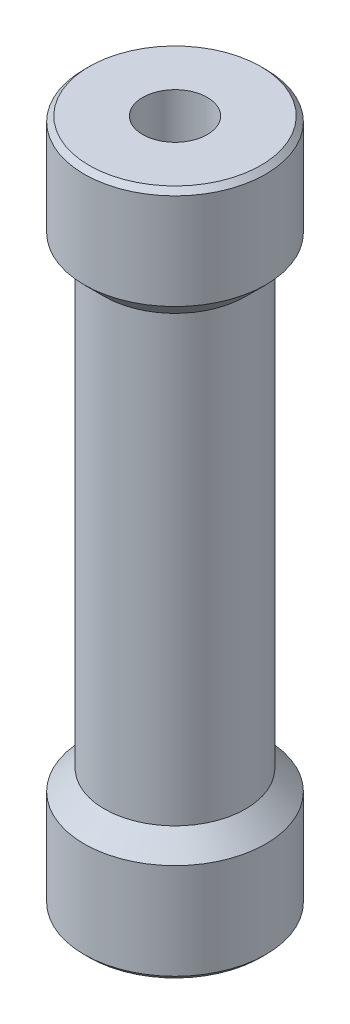
ISO-10303-21;
HEADER;
FILE_DESCRIPTION(('STEP AP214'),'2;1');
FILE_NAME('part.step','',(''),(''),'','','');
FILE_SCHEMA(('AUTOMOTIVE_DESIGN { 1 0 10303 214 1 1 1 1 }'));
ENDSEC;
DATA;
#1=APPLICATION_CONTEXT('core data for automotive mechanical design processes');
#2=APPLICATION_PROTOCOL_DEFINITION('international standard','automotive_design',2000,#1);
#3=PRODUCT_CONTEXT('',#1,'mechanical');
#4=PRODUCT('Part','Part','',(#3));
#5=PRODUCT_RELATED_PRODUCT_CATEGORY('part','',(#4));
#6=PRODUCT_DEFINITION_FORMATION('','',#4);
#7=PRODUCT_DEFINITION_CONTEXT('part definition',#1,'design');
#8=PRODUCT_DEFINITION('design','',#6,#7);
#9=PRODUCT_DEFINITION_SHAPE('','',#8);
#10=(LENGTH_UNIT() NAMED_UNIT(*) SI_UNIT(.MILLI.,.METRE.));
#11=(NAMED_UNIT(*) PLANE_ANGLE_UNIT() SI_UNIT($,.RADIAN.));
#12=(NAMED_UNIT(*) SI_UNIT($,.STERADIAN.) SOLID_ANGLE_UNIT());
#13=UNCERTAINTY_MEASURE_WITH_UNIT(LENGTH_MEASURE(1.E-05),#10,'distance_accuracy_value','');
#14=(GEOMETRIC_REPRESENTATION_CONTEXT(3) GLOBAL_UNCERTAINTY_ASSIGNED_CONTEXT((#13)) GLOBAL_UNIT_ASSIGNED_CONTEXT((#10,
#11,#12)) REPRESENTATION_CONTEXT('',''));
#15=CARTESIAN_POINT('',(0.,0.,0.));
#16=DIRECTION('',(0.,0.,1.));
#17=DIRECTION('',(1.,0.,0.));
#18=AXIS2_PLACEMENT_3D('',#15,#16,#17);
#19=CARTESIAN_POINT('',(0.,0.,0.));
#20=DIRECTION('',(0.,1.,0.));
#21=DIRECTION('',(0.,0.,1.));
#22=AXIS2_PLACEMENT_3D('',#19,#20,#21);
#23=CYLINDRICAL_SURFACE('',#22,1.6);
#24=CARTESIAN_POINT('',(0.,0.,0.));
#25=DIRECTION('',(0.,1.,0.));
#26=DIRECTION('',(0.,0.,1.));
#27=AXIS2_PLACEMENT_3D('',#24,#25,#26);
#28=CIRCLE('',#27,1.6);
#29=CARTESIAN_POINT('',(0.,0.,1.6));
#30=VERTEX_POINT('',#29);
#31=EDGE_CURVE('E45',#30,#30,#28,.F.);
#32=ORIENTED_EDGE('',*,*,#31,.T.);
#33=EDGE_LOOP('',(#32));
#34=FACE_BOUND('',#33,.T.);
#35=CARTESIAN_POINT('',(0.,34.,0.));
#36=DIRECTION('',(0.,1.,0.));
#37=DIRECTION('',(0.,0.,1.));
#38=AXIS2_PLACEMENT_3D('',#35,#36,#37);
#39=CIRCLE('',#38,1.6);
#40=CARTESIAN_POINT('',(0.,34.,1.6));
#41=VERTEX_POINT('',#40);
#42=EDGE_CURVE('E17',#41,#41,#39,.F.);
#43=ORIENTED_EDGE('',*,*,#42,.F.);
#44=EDGE_LOOP('',(#43));
#45=FACE_BOUND('',#44,.T.);
#46=ADVANCED_FACE('F14',(#34,#45),#23,.F.);
#47=CARTESIAN_POINT('',(0.,34.,0.));
#48=DIRECTION('',(0.,1.,0.));
#49=DIRECTION('',(0.,0.,1.));
#50=AXIS2_PLACEMENT_3D('',#47,#48,#49);
#51=PLANE('',#50);
#52=ORIENTED_EDGE('',*,*,#42,.T.);
#53=EDGE_LOOP('',(#52));
#54=FACE_BOUND('',#53,.T.);
#55=CARTESIAN_POINT('',(0.,33.9999999999918,0.));
#56=DIRECTION('',(0.,-1.,0.));
#57=DIRECTION('',(0.,0.,-1.));
#58=AXIS2_PLACEMENT_3D('',#55,#56,#57);
#59=CIRCLE('',#58,4.25000000001319);
#60=CARTESIAN_POINT('',(0.,33.9999999999918,-4.25000000001319));
#61=VERTEX_POINT('',#60);
#62=EDGE_CURVE('E43',#61,#61,#59,.T.);
#63=ORIENTED_EDGE('',*,*,#62,.F.);
#64=EDGE_LOOP('',(#63));
#65=FACE_BOUND('',#64,.T.);
#66=ADVANCED_FACE('F52',(#54,#65),#51,.T.);
#67=CARTESIAN_POINT('',(0.,0.,0.));
#68=DIRECTION('',(0.,1.,0.));
#69=DIRECTION('',(0.,0.,1.));
#70=AXIS2_PLACEMENT_3D('',#67,#68,#69);
#71=PLANE('',#70);
#72=ORIENTED_EDGE('',*,*,#31,.F.);
#73=EDGE_LOOP('',(#72));
#74=FACE_BOUND('',#73,.T.);
#75=CARTESIAN_POINT('',(0.,5.6843418860808E-11,0.));
#76=DIRECTION('',(0.,1.,0.));
#77=DIRECTION('',(0.,0.,1.));
#78=AXIS2_PLACEMENT_3D('',#75,#76,#77);
#79=CIRCLE('',#78,4.25000000001319);
#80=CARTESIAN_POINT('',(0.,5.6843418860808E-11,4.25000000001319));
#81=VERTEX_POINT('',#80);
#82=EDGE_CURVE('E38',#81,#81,#79,.T.);
#83=ORIENTED_EDGE('',*,*,#82,.F.);
#84=EDGE_LOOP('',(#83));
#85=FACE_BOUND('',#84,.T.);
#86=ADVANCED_FACE('F60',(#74,#85),#71,.F.);
#87=CARTESIAN_POINT('',(0.,33.749999999884,0.));
#88=DIRECTION('',(0.,-1.,0.));
#89=DIRECTION('',(0.,0.,-1.));
#90=AXIS2_PLACEMENT_3D('',#87,#88,#89);
#91=CONICAL_SURFACE('',#90,4.50000000012096,0.785398163397448);
#92=CARTESIAN_POINT('',(0.,33.75,0.));
#93=DIRECTION('',(0.,-1.,0.));
#94=DIRECTION('',(0.,0.,-1.));
#95=AXIS2_PLACEMENT_3D('',#92,#93,#94);
#96=CIRCLE('',#95,4.5);
#97=CARTESIAN_POINT('',(0.,33.75,-4.5));
#98=VERTEX_POINT('',#97);
#99=EDGE_CURVE('E33',#98,#98,#96,.T.);
#100=ORIENTED_EDGE('',*,*,#99,.F.);
#101=EDGE_LOOP('',(#100));
#102=FACE_BOUND('',#101,.T.);
#103=ORIENTED_EDGE('',*,*,#62,.T.);
#104=EDGE_LOOP('',(#103));
#105=FACE_BOUND('',#104,.T.);
#106=ADVANCED_FACE('F87',(#102,#105),#91,.T.);
#107=CARTESIAN_POINT('',(0.,0.250000000050932,0.));
#108=DIRECTION('',(0.,1.,0.));
#109=DIRECTION('',(0.,0.,1.));
#110=AXIS2_PLACEMENT_3D('',#107,#108,#109);
#111=CONICAL_SURFACE('',#110,4.50000000000728,0.785398163397448);
#112=ORIENTED_EDGE('',*,*,#82,.T.);
#113=EDGE_LOOP('',(#112));
#114=FACE_BOUND('',#113,.T.);
#115=CARTESIAN_POINT('',(0.,0.25,0.));
#116=DIRECTION('',(0.,1.,0.));
#117=DIRECTION('',(0.,0.,1.));
#118=AXIS2_PLACEMENT_3D('',#115,#116,#117);
#119=CIRCLE('',#118,4.5);
#120=CARTESIAN_POINT('',(0.,0.25,4.5));
#121=VERTEX_POINT('',#120);
#122=EDGE_CURVE('E29',#121,#121,#119,.T.);
#123=ORIENTED_EDGE('',*,*,#122,.F.);
#124=EDGE_LOOP('',(#123));
#125=FACE_BOUND('',#124,.T.);
#126=ADVANCED_FACE('F83',(#114,#125),#111,.T.);
#127=CARTESIAN_POINT('',(0.,34.,0.));
#128=DIRECTION('',(0.,-1.,0.));
#129=DIRECTION('',(0.,0.,-1.));
#130=AXIS2_PLACEMENT_3D('',#127,#128,#129);
#131=CYLINDRICAL_SURFACE('',#130,4.5);
#132=ORIENTED_EDGE('',*,*,#99,.T.);
#133=EDGE_LOOP('',(#132));
#134=FACE_BOUND('',#133,.T.);
#135=CARTESIAN_POINT('',(0.,29.0000000000532,0.));
#136=DIRECTION('',(0.,1.,0.));
#137=DIRECTION('',(1.,0.,0.));
#138=AXIS2_PLACEMENT_3D('',#135,#136,#137);
#139=CIRCLE('',#138,4.49999999995043);
#140=CARTESIAN_POINT('',(4.49999999995043,29.0000000000532,0.));
#141=VERTEX_POINT('',#140);
#142=EDGE_CURVE('E32',#141,#141,#139,.F.);
#143=ORIENTED_EDGE('',*,*,#142,.F.);
#144=EDGE_LOOP('',(#143));
#145=FACE_BOUND('',#144,.T.);
#146=ADVANCED_FACE('F79',(#134,#145),#131,.T.);
#147=CARTESIAN_POINT('',(0.,0.,0.));
#148=DIRECTION('',(0.,1.,0.));
#149=DIRECTION('',(0.,0.,1.));
#150=AXIS2_PLACEMENT_3D('',#147,#148,#149);
#151=CYLINDRICAL_SURFACE('',#150,4.5);
#152=ORIENTED_EDGE('',*,*,#122,.T.);
#153=EDGE_LOOP('',(#152));
#154=FACE_BOUND('',#153,.T.);
#155=CARTESIAN_POINT('',(0.,4.99999999999545,0.));
#156=DIRECTION('',(0.,-1.,0.));
#157=DIRECTION('',(1.,0.,0.));
#158=AXIS2_PLACEMENT_3D('',#155,#156,#157);
#159=CIRCLE('',#158,4.49999999995043);
#160=CARTESIAN_POINT('',(4.49999999995043,4.99999999999545,0.));
#161=VERTEX_POINT('',#160);
#162=EDGE_CURVE('E26',#161,#161,#159,.F.);
#163=ORIENTED_EDGE('',*,*,#162,.F.);
#164=EDGE_LOOP('',(#163));
#165=FACE_BOUND('',#164,.T.);
#166=ADVANCED_FACE('F75',(#154,#165),#151,.T.);
#167=CARTESIAN_POINT('',(0.,29.0000000000532,0.));
#168=DIRECTION('',(0.,1.,0.));
#169=DIRECTION('',(0.,0.,1.));
#170=AXIS2_PLACEMENT_3D('',#167,#168,#169);
#171=CONICAL_SURFACE('',#170,4.49999999995043,0.785398163369027);
#172=ORIENTED_EDGE('',*,*,#142,.T.);
#173=EDGE_LOOP('',(#172));
#174=FACE_BOUND('',#173,.T.);
#175=CARTESIAN_POINT('',(0.,28.,0.));
#176=DIRECTION('',(0.,1.,0.));
#177=DIRECTION('',(0.,0.,1.));
#178=AXIS2_PLACEMENT_3D('',#175,#176,#177);
#179=CIRCLE('',#178,3.5);
#180=CARTESIAN_POINT('',(0.,28.,3.5));
#181=VERTEX_POINT('',#180);
#182=EDGE_CURVE('E21',#181,#181,#179,.F.);
#183=ORIENTED_EDGE('',*,*,#182,.F.);
#184=EDGE_LOOP('',(#183));
#185=FACE_BOUND('',#184,.T.);
#186=ADVANCED_FACE('F68',(#174,#185),#171,.T.);
#187=CARTESIAN_POINT('',(0.,4.99999999999545,0.));
#188=DIRECTION('',(0.,-1.,0.));
#189=DIRECTION('',(0.,0.,-1.));
#190=AXIS2_PLACEMENT_3D('',#187,#188,#189);
#191=CONICAL_SURFACE('',#190,4.49999999995043,0.78539816342587);
#192=ORIENTED_EDGE('',*,*,#162,.T.);
#193=EDGE_LOOP('',(#192));
#194=FACE_BOUND('',#193,.T.);
#195=CARTESIAN_POINT('',(0.,6.,0.));
#196=DIRECTION('',(0.,1.,0.));
#197=DIRECTION('',(0.,0.,1.));
#198=AXIS2_PLACEMENT_3D('',#195,#196,#197);
#199=CIRCLE('',#198,3.5);
#200=CARTESIAN_POINT('',(0.,6.,3.5));
#201=VERTEX_POINT('',#200);
#202=EDGE_CURVE('E10',#201,#201,#199,.T.);
#203=ORIENTED_EDGE('',*,*,#202,.F.);
#204=EDGE_LOOP('',(#203));
#205=FACE_BOUND('',#204,.T.);
#206=ADVANCED_FACE('F63',(#194,#205),#191,.T.);
#207=CARTESIAN_POINT('',(0.,0.,0.));
#208=DIRECTION('',(0.,1.,0.));
#209=DIRECTION('',(0.,0.,1.));
#210=AXIS2_PLACEMENT_3D('',#207,#208,#209);
#211=CYLINDRICAL_SURFACE('',#210,3.5);
#212=ORIENTED_EDGE('',*,*,#202,.T.);
#213=EDGE_LOOP('',(#212));
#214=FACE_BOUND('',#213,.T.);
#215=ORIENTED_EDGE('',*,*,#182,.T.);
#216=EDGE_LOOP('',(#215));
#217=FACE_BOUND('',#216,.T.);
#218=ADVANCED_FACE('F61',(#214,#217),#211,.T.);
#219=CLOSED_SHELL('',(#46,#66,#86,#106,#126,#146,#166,#186,#206,#218));
#220=MANIFOLD_SOLID_BREP('B1',#219);
#221=ADVANCED_BREP_SHAPE_REPRESENTATION('',(#18,#220),#14);
#222=SHAPE_DEFINITION_REPRESENTATION(#9,#221);
ENDSEC;
END-ISO-10303-21;
